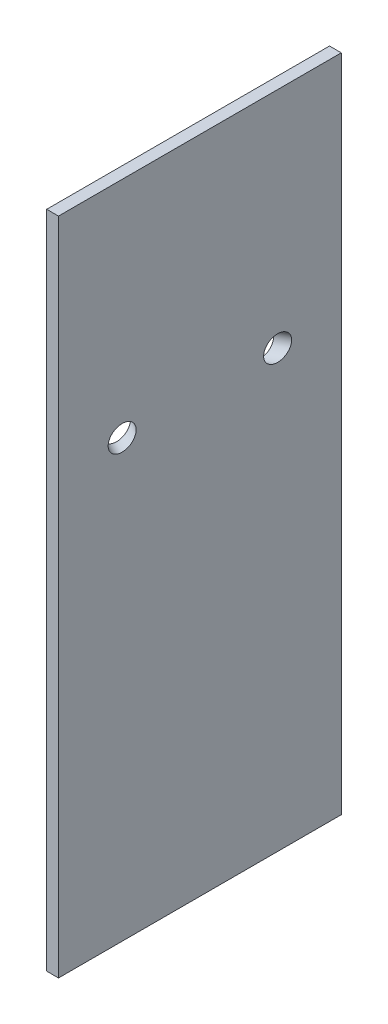
ISO-10303-21;
HEADER;
FILE_DESCRIPTION(('STEP AP214'),'2;1');
FILE_NAME('part.step','',(''),(''),'','','');
FILE_SCHEMA(('AUTOMOTIVE_DESIGN { 1 0 10303 214 1 1 1 1 }'));
ENDSEC;
DATA;
#1=APPLICATION_CONTEXT('core data for automotive mechanical design processes');
#2=APPLICATION_PROTOCOL_DEFINITION('international standard','automotive_design',2000,#1);
#3=PRODUCT_CONTEXT('',#1,'mechanical');
#4=PRODUCT('Part','Part','',(#3));
#5=PRODUCT_RELATED_PRODUCT_CATEGORY('part','',(#4));
#6=PRODUCT_DEFINITION_FORMATION('','',#4);
#7=PRODUCT_DEFINITION_CONTEXT('part definition',#1,'design');
#8=PRODUCT_DEFINITION('design','',#6,#7);
#9=PRODUCT_DEFINITION_SHAPE('','',#8);
#10=(LENGTH_UNIT() NAMED_UNIT(*) SI_UNIT(.MILLI.,.METRE.));
#11=(NAMED_UNIT(*) PLANE_ANGLE_UNIT() SI_UNIT($,.RADIAN.));
#12=(NAMED_UNIT(*) SI_UNIT($,.STERADIAN.) SOLID_ANGLE_UNIT());
#13=UNCERTAINTY_MEASURE_WITH_UNIT(LENGTH_MEASURE(1.E-05),#10,'distance_accuracy_value','');
#14=(GEOMETRIC_REPRESENTATION_CONTEXT(3) GLOBAL_UNCERTAINTY_ASSIGNED_CONTEXT((#13)) GLOBAL_UNIT_ASSIGNED_CONTEXT((#10,
#11,#12)) REPRESENTATION_CONTEXT('',''));
#15=CARTESIAN_POINT('',(0.,0.,0.));
#16=DIRECTION('',(0.,0.,1.));
#17=DIRECTION('',(1.,0.,0.));
#18=AXIS2_PLACEMENT_3D('',#15,#16,#17);
#19=CARTESIAN_POINT('',(6.35,355.6,-152.4));
#20=DIRECTION('',(0.,0.,1.));
#21=DIRECTION('',(0.,-1.,0.));
#22=AXIS2_PLACEMENT_3D('',#19,#20,#21);
#23=PLANE('',#22);
#24=DIRECTION('',(0.,1.,0.));
#25=VECTOR('',#24,1.);
#26=CARTESIAN_POINT('',(-6.35,355.6,-152.4));
#27=LINE('',#26,#25);
#28=CARTESIAN_POINT('',(-6.35,-355.6,-152.4));
#29=VERTEX_POINT('',#28);
#30=CARTESIAN_POINT('',(-6.35,355.6,-152.4));
#31=VERTEX_POINT('',#30);
#32=EDGE_CURVE('E119',#29,#31,#27,.T.);
#33=ORIENTED_EDGE('',*,*,#32,.T.);
#34=DIRECTION('',(-1.,0.,0.));
#35=VECTOR('',#34,1.);
#36=CARTESIAN_POINT('',(6.35,355.6,-152.4));
#37=LINE('',#36,#35);
#38=CARTESIAN_POINT('',(6.35,355.6,-152.4));
#39=VERTEX_POINT('',#38);
#40=EDGE_CURVE('E102',#39,#31,#37,.T.);
#41=ORIENTED_EDGE('',*,*,#40,.F.);
#42=DIRECTION('',(0.,1.,0.));
#43=VECTOR('',#42,1.);
#44=CARTESIAN_POINT('',(6.35,355.6,-152.4));
#45=LINE('',#44,#43);
#46=CARTESIAN_POINT('',(6.35,-355.6,-152.4));
#47=VERTEX_POINT('',#46);
#48=EDGE_CURVE('E129',#47,#39,#45,.T.);
#49=ORIENTED_EDGE('',*,*,#48,.F.);
#50=DIRECTION('',(-1.,0.,0.));
#51=VECTOR('',#50,1.);
#52=CARTESIAN_POINT('',(6.35,-355.6,-152.4));
#53=LINE('',#52,#51);
#54=EDGE_CURVE('E105',#47,#29,#53,.T.);
#55=ORIENTED_EDGE('',*,*,#54,.T.);
#56=EDGE_LOOP('',(#33,#41,#49,#55));
#57=FACE_BOUND('',#56,.T.);
#58=ADVANCED_FACE('F47',(#57),#23,.F.);
#59=CARTESIAN_POINT('',(6.35,355.6,152.4));
#60=DIRECTION('',(0.,-1.,0.));
#61=DIRECTION('',(0.,0.,-1.));
#62=AXIS2_PLACEMENT_3D('',#59,#60,#61);
#63=PLANE('',#62);
#64=DIRECTION('',(0.,0.,1.));
#65=VECTOR('',#64,1.);
#66=CARTESIAN_POINT('',(-6.35,355.6,152.4));
#67=LINE('',#66,#65);
#68=CARTESIAN_POINT('',(-6.35,355.6,152.4));
#69=VERTEX_POINT('',#68);
#70=EDGE_CURVE('E65',#31,#69,#67,.T.);
#71=ORIENTED_EDGE('',*,*,#70,.T.);
#72=DIRECTION('',(-1.,0.,0.));
#73=VECTOR('',#72,1.);
#74=CARTESIAN_POINT('',(6.35,355.6,152.4));
#75=LINE('',#74,#73);
#76=CARTESIAN_POINT('',(6.35,355.6,152.4));
#77=VERTEX_POINT('',#76);
#78=EDGE_CURVE('E99',#77,#69,#75,.T.);
#79=ORIENTED_EDGE('',*,*,#78,.F.);
#80=DIRECTION('',(0.,0.,1.));
#81=VECTOR('',#80,1.);
#82=CARTESIAN_POINT('',(6.35,355.6,152.4));
#83=LINE('',#82,#81);
#84=EDGE_CURVE('E81',#39,#77,#83,.T.);
#85=ORIENTED_EDGE('',*,*,#84,.F.);
#86=ORIENTED_EDGE('',*,*,#40,.T.);
#87=EDGE_LOOP('',(#71,#79,#85,#86));
#88=FACE_BOUND('',#87,.T.);
#89=ADVANCED_FACE('F98',(#88),#63,.F.);
#90=CARTESIAN_POINT('',(6.35,355.6,152.4));
#91=DIRECTION('',(0.,0.,-1.));
#92=DIRECTION('',(0.,1.,0.));
#93=AXIS2_PLACEMENT_3D('',#90,#91,#92);
#94=PLANE('',#93);
#95=DIRECTION('',(0.,-1.,0.));
#96=VECTOR('',#95,1.);
#97=CARTESIAN_POINT('',(-6.35,355.6,152.4));
#98=LINE('',#97,#96);
#99=CARTESIAN_POINT('',(-6.35,-355.6,152.4));
#100=VERTEX_POINT('',#99);
#101=EDGE_CURVE('E96',#69,#100,#98,.T.);
#102=ORIENTED_EDGE('',*,*,#101,.T.);
#103=DIRECTION('',(-1.,0.,0.));
#104=VECTOR('',#103,1.);
#105=CARTESIAN_POINT('',(6.35,-355.6,152.4));
#106=LINE('',#105,#104);
#107=CARTESIAN_POINT('',(6.35,-355.6,152.4));
#108=VERTEX_POINT('',#107);
#109=EDGE_CURVE('E141',#108,#100,#106,.T.);
#110=ORIENTED_EDGE('',*,*,#109,.F.);
#111=DIRECTION('',(0.,-1.,0.));
#112=VECTOR('',#111,1.);
#113=CARTESIAN_POINT('',(6.35,355.6,152.4));
#114=LINE('',#113,#112);
#115=EDGE_CURVE('E108',#77,#108,#114,.T.);
#116=ORIENTED_EDGE('',*,*,#115,.F.);
#117=ORIENTED_EDGE('',*,*,#78,.T.);
#118=EDGE_LOOP('',(#102,#110,#116,#117));
#119=FACE_BOUND('',#118,.T.);
#120=ADVANCED_FACE('F107',(#119),#94,.F.);
#121=CARTESIAN_POINT('',(6.35,-355.6,152.4));
#122=DIRECTION('',(0.,1.,0.));
#123=DIRECTION('',(0.,0.,1.));
#124=AXIS2_PLACEMENT_3D('',#121,#122,#123);
#125=PLANE('',#124);
#126=DIRECTION('',(0.,0.,-1.));
#127=VECTOR('',#126,1.);
#128=CARTESIAN_POINT('',(-6.35,-355.6,152.4));
#129=LINE('',#128,#127);
#130=EDGE_CURVE('E90',#100,#29,#129,.T.);
#131=ORIENTED_EDGE('',*,*,#130,.T.);
#132=ORIENTED_EDGE('',*,*,#54,.F.);
#133=DIRECTION('',(0.,0.,-1.));
#134=VECTOR('',#133,1.);
#135=CARTESIAN_POINT('',(6.35,-355.6,152.4));
#136=LINE('',#135,#134);
#137=EDGE_CURVE('E122',#108,#47,#136,.T.);
#138=ORIENTED_EDGE('',*,*,#137,.F.);
#139=ORIENTED_EDGE('',*,*,#109,.T.);
#140=EDGE_LOOP('',(#131,#132,#138,#139));
#141=FACE_BOUND('',#140,.T.);
#142=ADVANCED_FACE('F151',(#141),#125,.F.);
#143=CARTESIAN_POINT('',(6.35,0.,0.));
#144=DIRECTION('',(1.,0.,0.));
#145=DIRECTION('',(0.,0.,-1.));
#146=AXIS2_PLACEMENT_3D('',#143,#144,#145);
#147=PLANE('',#146);
#148=CARTESIAN_POINT('',(6.34999999999997,114.3,83.7861111111034));
#149=DIRECTION('',(1.,0.,0.));
#150=DIRECTION('',(0.,0.,1.));
#151=AXIS2_PLACEMENT_3D('',#148,#149,#150);
#152=ELLIPSE('',#151,15.0782789471129,13.335);
#153=CARTESIAN_POINT('',(6.34999999999997,114.3,98.8643900582163));
#154=VERTEX_POINT('',#153);
#155=EDGE_CURVE('E136',#154,#154,#152,.F.);
#156=ORIENTED_EDGE('',*,*,#155,.T.);
#157=EDGE_LOOP('',(#156));
#158=FACE_BOUND('',#157,.T.);
#159=CARTESIAN_POINT('',(6.35000000000002,114.3,-83.7861111111047));
#160=DIRECTION('',(1.,0.,0.));
#161=DIRECTION('',(0.,0.,1.));
#162=AXIS2_PLACEMENT_3D('',#159,#160,#161);
#163=ELLIPSE('',#162,15.0782789471129,13.335);
#164=CARTESIAN_POINT('',(6.35000000000002,114.3,-68.7078321639918));
#165=VERTEX_POINT('',#164);
#166=EDGE_CURVE('E132',#165,#165,#163,.F.);
#167=ORIENTED_EDGE('',*,*,#166,.T.);
#168=EDGE_LOOP('',(#167));
#169=FACE_BOUND('',#168,.T.);
#170=ORIENTED_EDGE('',*,*,#48,.T.);
#171=ORIENTED_EDGE('',*,*,#84,.T.);
#172=ORIENTED_EDGE('',*,*,#115,.T.);
#173=ORIENTED_EDGE('',*,*,#137,.T.);
#174=EDGE_LOOP('',(#170,#171,#172,#173));
#175=FACE_BOUND('',#174,.T.);
#176=ADVANCED_FACE('F152',(#158,#169,#175),#147,.T.);
#177=CARTESIAN_POINT('',(-6.35,0.,0.));
#178=DIRECTION('',(1.,0.,0.));
#179=DIRECTION('',(0.,0.,-1.));
#180=AXIS2_PLACEMENT_3D('',#177,#178,#179);
#181=PLANE('',#180);
#182=CARTESIAN_POINT('',(-6.34999999999997,114.3,77.0833333333254));
#183=DIRECTION('',(1.,0.,0.));
#184=DIRECTION('',(0.,0.,1.));
#185=AXIS2_PLACEMENT_3D('',#182,#183,#184);
#186=ELLIPSE('',#185,15.0782789471129,13.335);
#187=CARTESIAN_POINT('',(-6.34999999999997,114.3,92.1616122804384));
#188=VERTEX_POINT('',#187);
#189=EDGE_CURVE('E12',#188,#188,#186,.F.);
#190=ORIENTED_EDGE('',*,*,#189,.F.);
#191=EDGE_LOOP('',(#190));
#192=FACE_BOUND('',#191,.T.);
#193=CARTESIAN_POINT('',(-6.35000000000002,114.3,-77.0833333333266));
#194=DIRECTION('',(1.,0.,0.));
#195=DIRECTION('',(0.,0.,1.));
#196=AXIS2_PLACEMENT_3D('',#193,#194,#195);
#197=ELLIPSE('',#196,15.0782789471129,13.335);
#198=CARTESIAN_POINT('',(-6.35000000000002,114.3,-62.0050543862137));
#199=VERTEX_POINT('',#198);
#200=EDGE_CURVE('E57',#199,#199,#197,.F.);
#201=ORIENTED_EDGE('',*,*,#200,.F.);
#202=EDGE_LOOP('',(#201));
#203=FACE_BOUND('',#202,.T.);
#204=ORIENTED_EDGE('',*,*,#32,.F.);
#205=ORIENTED_EDGE('',*,*,#130,.F.);
#206=ORIENTED_EDGE('',*,*,#101,.F.);
#207=ORIENTED_EDGE('',*,*,#70,.F.);
#208=EDGE_LOOP('',(#204,#205,#206,#207));
#209=FACE_BOUND('',#208,.T.);
#210=ADVANCED_FACE('F111',(#192,#203,#209),#181,.F.);
#211=CARTESIAN_POINT('',(368.65,114.299999999998,-275.));
#212=DIRECTION('',(-0.884384752846963,0.,0.466758619558136));
#213=DIRECTION('',(0.466758619558136,0.,0.884384752846963));
#214=AXIS2_PLACEMENT_3D('',#211,#212,#213);
#215=CYLINDRICAL_SURFACE('',#214,13.335);
#216=ORIENTED_EDGE('',*,*,#166,.F.);
#217=EDGE_LOOP('',(#216));
#218=FACE_BOUND('',#217,.T.);
#219=ORIENTED_EDGE('',*,*,#200,.T.);
#220=EDGE_LOOP('',(#219));
#221=FACE_BOUND('',#220,.T.);
#222=ADVANCED_FACE('F159',(#218,#221),#215,.F.);
#223=CARTESIAN_POINT('',(-531.349999999963,114.300000000003,-200.));
#224=DIRECTION('',(0.884384752846962,0.,0.466758619558138));
#225=DIRECTION('',(0.466758619558138,0.,-0.884384752846962));
#226=AXIS2_PLACEMENT_3D('',#223,#224,#225);
#227=CYLINDRICAL_SURFACE('',#226,13.335);
#228=ORIENTED_EDGE('',*,*,#155,.F.);
#229=EDGE_LOOP('',(#228));
#230=FACE_BOUND('',#229,.T.);
#231=ORIENTED_EDGE('',*,*,#189,.T.);
#232=EDGE_LOOP('',(#231));
#233=FACE_BOUND('',#232,.T.);
#234=ADVANCED_FACE('F49',(#230,#233),#227,.F.);
#235=CLOSED_SHELL('',(#58,#89,#120,#142,#176,#210,#222,#234));
#236=MANIFOLD_SOLID_BREP('B2',#235);
#237=ADVANCED_BREP_SHAPE_REPRESENTATION('',(#18,#236),#14);
#238=SHAPE_DEFINITION_REPRESENTATION(#9,#237);
ENDSEC;
END-ISO-10303-21;
